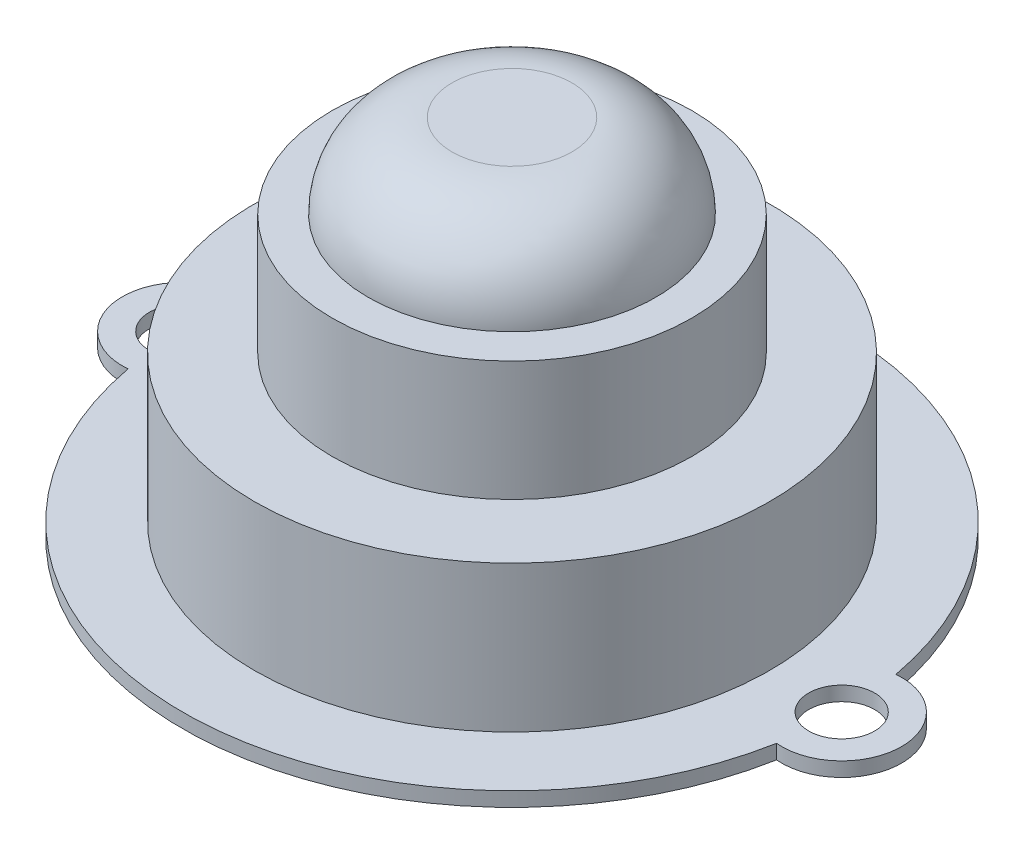
ISO-10303-21;
HEADER;
FILE_DESCRIPTION(('STEP AP214'),'2;1');
FILE_NAME('part.step','',(''),(''),'','','');
FILE_SCHEMA(('AUTOMOTIVE_DESIGN { 1 0 10303 214 1 1 1 1 }'));
ENDSEC;
DATA;
#1=APPLICATION_CONTEXT('core data for automotive mechanical design processes');
#2=APPLICATION_PROTOCOL_DEFINITION('international standard','automotive_design',2000,#1);
#3=PRODUCT_CONTEXT('',#1,'mechanical');
#4=PRODUCT('Part','Part','',(#3));
#5=PRODUCT_RELATED_PRODUCT_CATEGORY('part','',(#4));
#6=PRODUCT_DEFINITION_FORMATION('','',#4);
#7=PRODUCT_DEFINITION_CONTEXT('part definition',#1,'design');
#8=PRODUCT_DEFINITION('design','',#6,#7);
#9=PRODUCT_DEFINITION_SHAPE('','',#8);
#10=(LENGTH_UNIT() NAMED_UNIT(*) SI_UNIT(.MILLI.,.METRE.));
#11=(NAMED_UNIT(*) PLANE_ANGLE_UNIT() SI_UNIT($,.RADIAN.));
#12=(NAMED_UNIT(*) SI_UNIT($,.STERADIAN.) SOLID_ANGLE_UNIT());
#13=UNCERTAINTY_MEASURE_WITH_UNIT(LENGTH_MEASURE(1.E-05),#10,'distance_accuracy_value','');
#14=(GEOMETRIC_REPRESENTATION_CONTEXT(3) GLOBAL_UNCERTAINTY_ASSIGNED_CONTEXT((#13)) GLOBAL_UNIT_ASSIGNED_CONTEXT((#10,
#11,#12)) REPRESENTATION_CONTEXT('',''));
#15=CARTESIAN_POINT('',(0.,0.,0.));
#16=DIRECTION('',(0.,0.,1.));
#17=DIRECTION('',(1.,0.,0.));
#18=AXIS2_PLACEMENT_3D('',#15,#16,#17);
#19=CARTESIAN_POINT('',(0.,23.4,0.));
#20=DIRECTION('',(0.,1.,0.));
#21=DIRECTION('',(0.,0.,1.));
#22=AXIS2_PLACEMENT_3D('',#19,#20,#21);
#23=PLANE('',#22);
#24=CARTESIAN_POINT('',(0.,23.4,0.));
#25=DIRECTION('',(0.,1.,0.));
#26=DIRECTION('',(0.,0.,1.));
#27=AXIS2_PLACEMENT_3D('',#24,#25,#26);
#28=CIRCLE('',#27,15.);
#29=CARTESIAN_POINT('',(0.,23.4,15.));
#30=VERTEX_POINT('',#29);
#31=EDGE_CURVE('E182',#30,#30,#28,.T.);
#32=ORIENTED_EDGE('',*,*,#31,.T.);
#33=EDGE_LOOP('',(#32));
#34=FACE_BOUND('',#33,.T.);
#35=CARTESIAN_POINT('',(0.,23.4,0.));
#36=DIRECTION('',(0.,1.,0.));
#37=DIRECTION('',(0.,0.,1.));
#38=AXIS2_PLACEMENT_3D('',#35,#36,#37);
#39=CIRCLE('',#38,12.);
#40=CARTESIAN_POINT('',(0.,23.4,12.));
#41=VERTEX_POINT('',#40);
#42=EDGE_CURVE('E187',#41,#41,#39,.T.);
#43=ORIENTED_EDGE('',*,*,#42,.F.);
#44=EDGE_LOOP('',(#43));
#45=FACE_BOUND('',#44,.T.);
#46=ADVANCED_FACE('F33',(#34,#45),#23,.T.);
#47=CARTESIAN_POINT('',(0.,13.4,0.));
#48=DIRECTION('',(0.,1.,0.));
#49=DIRECTION('',(0.,0.,1.));
#50=AXIS2_PLACEMENT_3D('',#47,#48,#49);
#51=PLANE('',#50);
#52=CARTESIAN_POINT('',(0.,13.4,0.));
#53=DIRECTION('',(0.,1.,0.));
#54=DIRECTION('',(0.,0.,1.));
#55=AXIS2_PLACEMENT_3D('',#52,#53,#54);
#56=CIRCLE('',#55,21.5);
#57=CARTESIAN_POINT('',(0.,13.4,21.5));
#58=VERTEX_POINT('',#57);
#59=EDGE_CURVE('E123',#58,#58,#56,.T.);
#60=ORIENTED_EDGE('',*,*,#59,.T.);
#61=EDGE_LOOP('',(#60));
#62=FACE_BOUND('',#61,.T.);
#63=CARTESIAN_POINT('',(0.,13.4,0.));
#64=DIRECTION('',(0.,1.,0.));
#65=DIRECTION('',(0.,0.,1.));
#66=AXIS2_PLACEMENT_3D('',#63,#64,#65);
#67=CIRCLE('',#66,15.);
#68=CARTESIAN_POINT('',(0.,13.4,15.));
#69=VERTEX_POINT('',#68);
#70=EDGE_CURVE('E183',#69,#69,#67,.T.);
#71=ORIENTED_EDGE('',*,*,#70,.F.);
#72=EDGE_LOOP('',(#71));
#73=FACE_BOUND('',#72,.T.);
#74=ADVANCED_FACE('F154',(#62,#73),#51,.T.);
#75=CARTESIAN_POINT('',(13.75,1.2,0.));
#76=DIRECTION('',(0.,1.,0.));
#77=DIRECTION('',(0.,0.,1.));
#78=AXIS2_PLACEMENT_3D('',#75,#76,#77);
#79=PLANE('',#78);
#80=CARTESIAN_POINT('',(27.5,1.2,0.));
#81=DIRECTION('',(0.,1.,0.));
#82=DIRECTION('',(0.,0.,1.));
#83=AXIS2_PLACEMENT_3D('',#80,#81,#82);
#84=CIRCLE('',#83,2.75);
#85=CARTESIAN_POINT('',(27.5,1.2,2.75));
#86=VERTEX_POINT('',#85);
#87=EDGE_CURVE('E122',#86,#86,#84,.T.);
#88=ORIENTED_EDGE('',*,*,#87,.F.);
#89=EDGE_LOOP('',(#88));
#90=FACE_BOUND('',#89,.T.);
#91=CARTESIAN_POINT('',(27.5,1.2,0.));
#92=DIRECTION('',(0.,1.,0.));
#93=DIRECTION('',(0.,0.,1.));
#94=AXIS2_PLACEMENT_3D('',#91,#92,#93);
#95=CIRCLE('',#94,5.);
#96=CARTESIAN_POINT('',(27.0454545454545,1.2,4.97929597731969));
#97=VERTEX_POINT('',#96);
#98=CARTESIAN_POINT('',(27.0454545454545,1.2,-4.97929597731969));
#99=VERTEX_POINT('',#98);
#100=EDGE_CURVE('E87',#97,#99,#95,.T.);
#101=ORIENTED_EDGE('',*,*,#100,.T.);
#102=CARTESIAN_POINT('',(0.,1.2,0.));
#103=DIRECTION('',(0.,1.,0.));
#104=DIRECTION('',(0.,0.,1.));
#105=AXIS2_PLACEMENT_3D('',#102,#103,#104);
#106=CIRCLE('',#105,27.5);
#107=CARTESIAN_POINT('',(-27.0454545454545,1.2,-4.97929597731969));
#108=VERTEX_POINT('',#107);
#109=EDGE_CURVE('E81',#99,#108,#106,.T.);
#110=ORIENTED_EDGE('',*,*,#109,.T.);
#111=CARTESIAN_POINT('',(-27.5,1.2,0.));
#112=DIRECTION('',(0.,1.,0.));
#113=DIRECTION('',(0.,0.,1.));
#114=AXIS2_PLACEMENT_3D('',#111,#112,#113);
#115=CIRCLE('',#114,5.);
#116=CARTESIAN_POINT('',(-27.0454545454545,1.2,4.97929597731968));
#117=VERTEX_POINT('',#116);
#118=EDGE_CURVE('E85',#108,#117,#115,.T.);
#119=ORIENTED_EDGE('',*,*,#118,.T.);
#120=CARTESIAN_POINT('',(0.,1.2,0.));
#121=DIRECTION('',(0.,1.,0.));
#122=DIRECTION('',(0.,0.,1.));
#123=AXIS2_PLACEMENT_3D('',#120,#121,#122);
#124=CIRCLE('',#123,27.5);
#125=EDGE_CURVE('E50',#117,#97,#124,.T.);
#126=ORIENTED_EDGE('',*,*,#125,.T.);
#127=EDGE_LOOP('',(#101,#110,#119,#126));
#128=FACE_BOUND('',#127,.T.);
#129=CARTESIAN_POINT('',(-27.5,1.2,0.));
#130=DIRECTION('',(0.,1.,0.));
#131=DIRECTION('',(0.,0.,1.));
#132=AXIS2_PLACEMENT_3D('',#129,#130,#131);
#133=CIRCLE('',#132,2.75);
#134=CARTESIAN_POINT('',(-27.5,1.2,2.75));
#135=VERTEX_POINT('',#134);
#136=EDGE_CURVE('E104',#135,#135,#133,.T.);
#137=ORIENTED_EDGE('',*,*,#136,.F.);
#138=EDGE_LOOP('',(#137));
#139=FACE_BOUND('',#138,.T.);
#140=CARTESIAN_POINT('',(0.,1.2,0.));
#141=DIRECTION('',(0.,1.,0.));
#142=DIRECTION('',(0.,0.,1.));
#143=AXIS2_PLACEMENT_3D('',#140,#141,#142);
#144=CIRCLE('',#143,21.5);
#145=CARTESIAN_POINT('',(0.,1.2,21.5));
#146=VERTEX_POINT('',#145);
#147=EDGE_CURVE('E129',#146,#146,#144,.T.);
#148=ORIENTED_EDGE('',*,*,#147,.F.);
#149=EDGE_LOOP('',(#148));
#150=FACE_BOUND('',#149,.T.);
#151=ADVANCED_FACE('F82',(#90,#128,#139,#150),#79,.T.);
#152=CARTESIAN_POINT('',(13.75,0.,0.));
#153=DIRECTION('',(0.,1.,0.));
#154=DIRECTION('',(0.,0.,1.));
#155=AXIS2_PLACEMENT_3D('',#152,#153,#154);
#156=PLANE('',#155);
#157=CARTESIAN_POINT('',(-27.5,0.,0.));
#158=DIRECTION('',(0.,1.,0.));
#159=DIRECTION('',(0.,0.,1.));
#160=AXIS2_PLACEMENT_3D('',#157,#158,#159);
#161=CIRCLE('',#160,2.75);
#162=CARTESIAN_POINT('',(-27.5,0.,2.75));
#163=VERTEX_POINT('',#162);
#164=EDGE_CURVE('E126',#163,#163,#161,.T.);
#165=ORIENTED_EDGE('',*,*,#164,.T.);
#166=EDGE_LOOP('',(#165));
#167=FACE_BOUND('',#166,.T.);
#168=CARTESIAN_POINT('',(27.5,0.,0.));
#169=DIRECTION('',(0.,1.,0.));
#170=DIRECTION('',(0.,0.,1.));
#171=AXIS2_PLACEMENT_3D('',#168,#169,#170);
#172=CIRCLE('',#171,5.);
#173=CARTESIAN_POINT('',(27.0454545454545,0.,4.97929597731969));
#174=VERTEX_POINT('',#173);
#175=CARTESIAN_POINT('',(27.0454545454545,0.,-4.97929597731969));
#176=VERTEX_POINT('',#175);
#177=EDGE_CURVE('E101',#174,#176,#172,.T.);
#178=ORIENTED_EDGE('',*,*,#177,.F.);
#179=CARTESIAN_POINT('',(0.,0.,0.));
#180=DIRECTION('',(0.,1.,0.));
#181=DIRECTION('',(0.,0.,1.));
#182=AXIS2_PLACEMENT_3D('',#179,#180,#181);
#183=CIRCLE('',#182,27.5);
#184=CARTESIAN_POINT('',(-27.0454545454545,0.,4.97929597731968));
#185=VERTEX_POINT('',#184);
#186=EDGE_CURVE('E73',#185,#174,#183,.T.);
#187=ORIENTED_EDGE('',*,*,#186,.F.);
#188=CARTESIAN_POINT('',(-27.5,0.,0.));
#189=DIRECTION('',(0.,1.,0.));
#190=DIRECTION('',(0.,0.,1.));
#191=AXIS2_PLACEMENT_3D('',#188,#189,#190);
#192=CIRCLE('',#191,5.);
#193=CARTESIAN_POINT('',(-27.0454545454545,0.,-4.97929597731969));
#194=VERTEX_POINT('',#193);
#195=EDGE_CURVE('E67',#194,#185,#192,.T.);
#196=ORIENTED_EDGE('',*,*,#195,.F.);
#197=CARTESIAN_POINT('',(0.,0.,0.));
#198=DIRECTION('',(0.,1.,0.));
#199=DIRECTION('',(0.,0.,1.));
#200=AXIS2_PLACEMENT_3D('',#197,#198,#199);
#201=CIRCLE('',#200,27.5);
#202=EDGE_CURVE('E92',#176,#194,#201,.T.);
#203=ORIENTED_EDGE('',*,*,#202,.F.);
#204=EDGE_LOOP('',(#178,#187,#196,#203));
#205=FACE_BOUND('',#204,.T.);
#206=CARTESIAN_POINT('',(27.5,0.,0.));
#207=DIRECTION('',(0.,1.,0.));
#208=DIRECTION('',(0.,0.,1.));
#209=AXIS2_PLACEMENT_3D('',#206,#207,#208);
#210=CIRCLE('',#209,2.75);
#211=CARTESIAN_POINT('',(27.5,0.,2.75));
#212=VERTEX_POINT('',#211);
#213=EDGE_CURVE('E120',#212,#212,#210,.T.);
#214=ORIENTED_EDGE('',*,*,#213,.T.);
#215=EDGE_LOOP('',(#214));
#216=FACE_BOUND('',#215,.T.);
#217=ADVANCED_FACE('F113',(#167,#205,#216),#156,.F.);
#218=CARTESIAN_POINT('',(27.5,1.2,0.));
#219=DIRECTION('',(0.,-1.,0.));
#220=DIRECTION('',(0.,0.,-1.));
#221=AXIS2_PLACEMENT_3D('',#218,#219,#220);
#222=CYLINDRICAL_SURFACE('',#221,5.);
#223=ORIENTED_EDGE('',*,*,#177,.T.);
#224=DIRECTION('',(0.,-1.,0.));
#225=VECTOR('',#224,1.);
#226=CARTESIAN_POINT('',(27.0454545454545,1.2,-4.97929597731969));
#227=LINE('',#226,#225);
#228=EDGE_CURVE('E42',#99,#176,#227,.T.);
#229=ORIENTED_EDGE('',*,*,#228,.F.);
#230=ORIENTED_EDGE('',*,*,#100,.F.);
#231=DIRECTION('',(0.,-1.,0.));
#232=VECTOR('',#231,1.);
#233=CARTESIAN_POINT('',(27.0454545454545,1.2,4.97929597731969));
#234=LINE('',#233,#232);
#235=EDGE_CURVE('E97',#97,#174,#234,.T.);
#236=ORIENTED_EDGE('',*,*,#235,.T.);
#237=EDGE_LOOP('',(#223,#229,#230,#236));
#238=FACE_BOUND('',#237,.T.);
#239=ADVANCED_FACE('F111',(#238),#222,.T.);
#240=CARTESIAN_POINT('',(0.,1.2,0.));
#241=DIRECTION('',(0.,-1.,0.));
#242=DIRECTION('',(0.,0.,-1.));
#243=AXIS2_PLACEMENT_3D('',#240,#241,#242);
#244=CYLINDRICAL_SURFACE('',#243,27.5);
#245=ORIENTED_EDGE('',*,*,#202,.T.);
#246=DIRECTION('',(0.,-1.,0.));
#247=VECTOR('',#246,1.);
#248=CARTESIAN_POINT('',(-27.0454545454545,1.2,-4.97929597731969));
#249=LINE('',#248,#247);
#250=EDGE_CURVE('E90',#108,#194,#249,.T.);
#251=ORIENTED_EDGE('',*,*,#250,.F.);
#252=ORIENTED_EDGE('',*,*,#109,.F.);
#253=ORIENTED_EDGE('',*,*,#228,.T.);
#254=EDGE_LOOP('',(#245,#251,#252,#253));
#255=FACE_BOUND('',#254,.T.);
#256=ADVANCED_FACE('F91',(#255),#244,.T.);
#257=CARTESIAN_POINT('',(-27.5,1.2,0.));
#258=DIRECTION('',(0.,-1.,0.));
#259=DIRECTION('',(0.,0.,-1.));
#260=AXIS2_PLACEMENT_3D('',#257,#258,#259);
#261=CYLINDRICAL_SURFACE('',#260,5.);
#262=ORIENTED_EDGE('',*,*,#195,.T.);
#263=DIRECTION('',(0.,-1.,0.));
#264=VECTOR('',#263,1.);
#265=CARTESIAN_POINT('',(-27.0454545454545,1.2,4.97929597731968));
#266=LINE('',#265,#264);
#267=EDGE_CURVE('E93',#117,#185,#266,.T.);
#268=ORIENTED_EDGE('',*,*,#267,.F.);
#269=ORIENTED_EDGE('',*,*,#118,.F.);
#270=ORIENTED_EDGE('',*,*,#250,.T.);
#271=EDGE_LOOP('',(#262,#268,#269,#270));
#272=FACE_BOUND('',#271,.T.);
#273=ADVANCED_FACE('F95',(#272),#261,.T.);
#274=CARTESIAN_POINT('',(0.,1.2,0.));
#275=DIRECTION('',(0.,-1.,0.));
#276=DIRECTION('',(0.,0.,-1.));
#277=AXIS2_PLACEMENT_3D('',#274,#275,#276);
#278=CYLINDRICAL_SURFACE('',#277,27.5);
#279=ORIENTED_EDGE('',*,*,#186,.T.);
#280=ORIENTED_EDGE('',*,*,#235,.F.);
#281=ORIENTED_EDGE('',*,*,#125,.F.);
#282=ORIENTED_EDGE('',*,*,#267,.T.);
#283=EDGE_LOOP('',(#279,#280,#281,#282));
#284=FACE_BOUND('',#283,.T.);
#285=ADVANCED_FACE('F141',(#284),#278,.T.);
#286=CARTESIAN_POINT('',(-27.5,1.2,0.));
#287=DIRECTION('',(0.,-1.,0.));
#288=DIRECTION('',(0.,0.,-1.));
#289=AXIS2_PLACEMENT_3D('',#286,#287,#288);
#290=CYLINDRICAL_SURFACE('',#289,2.75);
#291=ORIENTED_EDGE('',*,*,#136,.T.);
#292=EDGE_LOOP('',(#291));
#293=FACE_BOUND('',#292,.T.);
#294=ORIENTED_EDGE('',*,*,#164,.F.);
#295=EDGE_LOOP('',(#294));
#296=FACE_BOUND('',#295,.T.);
#297=ADVANCED_FACE('F138',(#293,#296),#290,.F.);
#298=CARTESIAN_POINT('',(27.5,1.2,0.));
#299=DIRECTION('',(0.,-1.,0.));
#300=DIRECTION('',(0.,0.,-1.));
#301=AXIS2_PLACEMENT_3D('',#298,#299,#300);
#302=CYLINDRICAL_SURFACE('',#301,2.75);
#303=ORIENTED_EDGE('',*,*,#87,.T.);
#304=EDGE_LOOP('',(#303));
#305=FACE_BOUND('',#304,.T.);
#306=ORIENTED_EDGE('',*,*,#213,.F.);
#307=EDGE_LOOP('',(#306));
#308=FACE_BOUND('',#307,.T.);
#309=ADVANCED_FACE('F140',(#305,#308),#302,.F.);
#310=CARTESIAN_POINT('',(0.,13.4,0.));
#311=DIRECTION('',(0.,-1.,0.));
#312=DIRECTION('',(0.,0.,-1.));
#313=AXIS2_PLACEMENT_3D('',#310,#311,#312);
#314=CYLINDRICAL_SURFACE('',#313,21.5);
#315=ORIENTED_EDGE('',*,*,#59,.F.);
#316=EDGE_LOOP('',(#315));
#317=FACE_BOUND('',#316,.T.);
#318=ORIENTED_EDGE('',*,*,#147,.T.);
#319=EDGE_LOOP('',(#318));
#320=FACE_BOUND('',#319,.T.);
#321=ADVANCED_FACE('F148',(#317,#320),#314,.T.);
#322=CARTESIAN_POINT('',(0.,23.4,0.));
#323=DIRECTION('',(0.,-1.,0.));
#324=DIRECTION('',(0.,0.,-1.));
#325=AXIS2_PLACEMENT_3D('',#322,#323,#324);
#326=CYLINDRICAL_SURFACE('',#325,15.);
#327=ORIENTED_EDGE('',*,*,#31,.F.);
#328=EDGE_LOOP('',(#327));
#329=FACE_BOUND('',#328,.T.);
#330=ORIENTED_EDGE('',*,*,#70,.T.);
#331=EDGE_LOOP('',(#330));
#332=FACE_BOUND('',#331,.T.);
#333=ADVANCED_FACE('F169',(#329,#332),#326,.T.);
#334=CARTESIAN_POINT('',(0.,30.4,0.));
#335=DIRECTION('',(0.,1.,0.));
#336=DIRECTION('',(0.,0.,1.));
#337=AXIS2_PLACEMENT_3D('',#334,#335,#336);
#338=PLANE('',#337);
#339=CARTESIAN_POINT('',(0.,30.4,0.));
#340=DIRECTION('',(0.,1.,0.));
#341=DIRECTION('',(0.,0.,1.));
#342=AXIS2_PLACEMENT_3D('',#339,#340,#341);
#343=CIRCLE('',#342,5.);
#344=CARTESIAN_POINT('',(0.,30.4,5.));
#345=VERTEX_POINT('',#344);
#346=EDGE_CURVE('E11',#345,#345,#343,.T.);
#347=ORIENTED_EDGE('',*,*,#346,.T.);
#348=EDGE_LOOP('',(#347));
#349=FACE_BOUND('',#348,.T.);
#350=ADVANCED_FACE('F168',(#349),#338,.T.);
#351=CARTESIAN_POINT('',(0.,23.4,0.));
#352=DIRECTION('',(0.,1.,0.));
#353=DIRECTION('',(0.,0.,1.));
#354=AXIS2_PLACEMENT_3D('',#351,#352,#353);
#355=DEGENERATE_TOROIDAL_SURFACE('',#354,5.,7.,.T.);
#356=ORIENTED_EDGE('',*,*,#42,.T.);
#357=EDGE_LOOP('',(#356));
#358=FACE_BOUND('',#357,.T.);
#359=ORIENTED_EDGE('',*,*,#346,.F.);
#360=EDGE_LOOP('',(#359));
#361=FACE_BOUND('',#360,.T.);
#362=ADVANCED_FACE('F35',(#358,#361),#355,.T.);
#363=CLOSED_SHELL('',(#46,#74,#151,#217,#239,#256,#273,#285,#297,#309,#321,#333,#350,#362));
#364=MANIFOLD_SOLID_BREP('B2',#363);
#365=ADVANCED_BREP_SHAPE_REPRESENTATION('',(#18,#364),#14);
#366=SHAPE_DEFINITION_REPRESENTATION(#9,#365);
ENDSEC;
END-ISO-10303-21;
